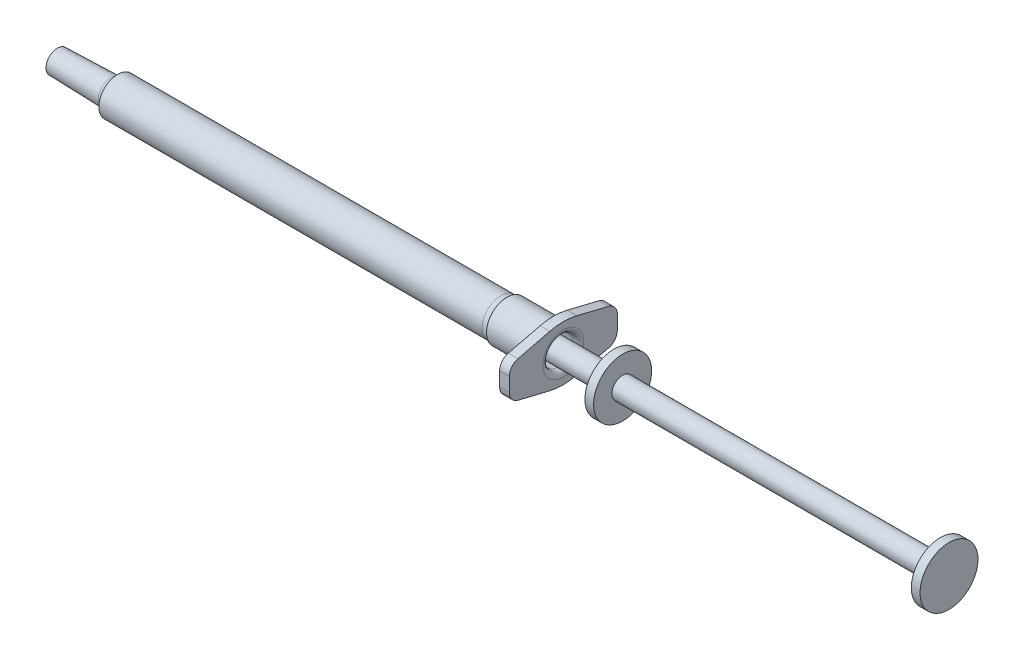
ISO-10303-21;
HEADER;
FILE_DESCRIPTION(('STEP AP214'),'2;1');
FILE_NAME('part.step','',(''),(''),'','','');
FILE_SCHEMA(('AUTOMOTIVE_DESIGN { 1 0 10303 214 1 1 1 1 }'));
ENDSEC;
DATA;
#1=APPLICATION_CONTEXT('core data for automotive mechanical design processes');
#2=APPLICATION_PROTOCOL_DEFINITION('international standard','automotive_design',2000,#1);
#3=PRODUCT_CONTEXT('',#1,'mechanical');
#4=PRODUCT('Part','Part','',(#3));
#5=PRODUCT_RELATED_PRODUCT_CATEGORY('part','',(#4));
#6=PRODUCT_DEFINITION_FORMATION('','',#4);
#7=PRODUCT_DEFINITION_CONTEXT('part definition',#1,'design');
#8=PRODUCT_DEFINITION('design','',#6,#7);
#9=PRODUCT_DEFINITION_SHAPE('','',#8);
#10=(LENGTH_UNIT() NAMED_UNIT(*) SI_UNIT(.MILLI.,.METRE.));
#11=(NAMED_UNIT(*) PLANE_ANGLE_UNIT() SI_UNIT($,.RADIAN.));
#12=(NAMED_UNIT(*) SI_UNIT($,.STERADIAN.) SOLID_ANGLE_UNIT());
#13=UNCERTAINTY_MEASURE_WITH_UNIT(LENGTH_MEASURE(1.E-05),#10,'distance_accuracy_value','');
#14=(GEOMETRIC_REPRESENTATION_CONTEXT(3) GLOBAL_UNCERTAINTY_ASSIGNED_CONTEXT((#13)) GLOBAL_UNIT_ASSIGNED_CONTEXT((#10,
#11,#12)) REPRESENTATION_CONTEXT('',''));
#15=CARTESIAN_POINT('',(0.,0.,0.));
#16=DIRECTION('',(0.,0.,1.));
#17=DIRECTION('',(1.,0.,0.));
#18=AXIS2_PLACEMENT_3D('',#15,#16,#17);
#19=CARTESIAN_POINT('',(11.168160758688,2.53109089025904,0.));
#20=DIRECTION('',(1.,0.,0.));
#21=DIRECTION('',(0.,0.,-1.));
#22=AXIS2_PLACEMENT_3D('',#19,#20,#21);
#23=CONICAL_SURFACE('',#22,2.54455467620265,1.31977107893144);
#24=CARTESIAN_POINT('',(10.5156496587241,2.53109089025904,0.));
#25=VERTEX_POINT('',#24);
#26=VERTEX_LOOP('',#25);
#27=FACE_BOUND('',#26,.T.);
#28=CARTESIAN_POINT('',(11.168160758688,2.53109089025904,0.));
#29=DIRECTION('',(1.,0.,0.));
#30=DIRECTION('',(0.,0.,-1.));
#31=AXIS2_PLACEMENT_3D('',#28,#29,#30);
#32=CIRCLE('',#31,2.54455467620265);
#33=CARTESIAN_POINT('',(11.168160758688,2.53109089025904,-2.54455467620265));
#34=VERTEX_POINT('',#33);
#35=EDGE_CURVE('E12',#34,#34,#32,.T.);
#36=ORIENTED_EDGE('',*,*,#35,.F.);
#37=EDGE_LOOP('',(#36));
#38=FACE_BOUND('',#37,.T.);
#39=ADVANCED_FACE('F44',(#27,#38),#23,.T.);
#40=CARTESIAN_POINT('',(105.8865547452,2.53109089025904,0.));
#41=DIRECTION('',(1.,0.,0.));
#42=DIRECTION('',(0.,0.,-1.));
#43=AXIS2_PLACEMENT_3D('',#40,#41,#42);
#44=CYLINDRICAL_SURFACE('',#43,2.54455467620265);
#45=ORIENTED_EDGE('',*,*,#35,.T.);
#46=EDGE_LOOP('',(#45));
#47=FACE_BOUND('',#46,.T.);
#48=CARTESIAN_POINT('',(16.3440700927071,2.53109089025904,0.));
#49=DIRECTION('',(1.,0.,0.));
#50=DIRECTION('',(0.,0.,-1.));
#51=AXIS2_PLACEMENT_3D('',#48,#49,#50);
#52=CIRCLE('',#51,2.54455467620265);
#53=CARTESIAN_POINT('',(16.3440700927071,2.53109089025904,-2.54455467620265));
#54=VERTEX_POINT('',#53);
#55=EDGE_CURVE('E50',#54,#54,#52,.T.);
#56=ORIENTED_EDGE('',*,*,#55,.F.);
#57=EDGE_LOOP('',(#56));
#58=FACE_BOUND('',#57,.T.);
#59=ADVANCED_FACE('F55',(#47,#58),#44,.T.);
#60=CARTESIAN_POINT('',(16.5055856602395,2.53109089025904,0.));
#61=DIRECTION('',(-1.,0.,0.));
#62=DIRECTION('',(0.,0.,1.));
#63=AXIS2_PLACEMENT_3D('',#60,#61,#62);
#64=CONICAL_SURFACE('',#63,1.89,1.32887276851603);
#65=ORIENTED_EDGE('',*,*,#55,.T.);
#66=EDGE_LOOP('',(#65));
#67=FACE_BOUND('',#66,.T.);
#68=CARTESIAN_POINT('',(16.5055856602395,2.53109089025904,0.));
#69=DIRECTION('',(1.,0.,0.));
#70=DIRECTION('',(0.,0.,-1.));
#71=AXIS2_PLACEMENT_3D('',#68,#69,#70);
#72=CIRCLE('',#71,1.89);
#73=CARTESIAN_POINT('',(16.5055856602395,2.53109089025904,-1.89));
#74=VERTEX_POINT('',#73);
#75=EDGE_CURVE('E64',#74,#74,#72,.T.);
#76=ORIENTED_EDGE('',*,*,#75,.F.);
#77=EDGE_LOOP('',(#76));
#78=FACE_BOUND('',#77,.T.);
#79=ADVANCED_FACE('F60',(#67,#78),#64,.T.);
#80=CARTESIAN_POINT('',(105.8865547452,2.53109089025904,0.));
#81=DIRECTION('',(1.,0.,0.));
#82=DIRECTION('',(0.,0.,-1.));
#83=AXIS2_PLACEMENT_3D('',#80,#81,#82);
#84=CYLINDRICAL_SURFACE('',#83,1.89);
#85=ORIENTED_EDGE('',*,*,#75,.T.);
#86=EDGE_LOOP('',(#85));
#87=FACE_BOUND('',#86,.T.);
#88=CARTESIAN_POINT('',(97.878125799525,2.53109089025904,0.));
#89=DIRECTION('',(1.,0.,0.));
#90=DIRECTION('',(0.,0.,-1.));
#91=AXIS2_PLACEMENT_3D('',#88,#89,#90);
#92=CIRCLE('',#91,1.89);
#93=CARTESIAN_POINT('',(97.878125799525,2.53109089025904,-1.89));
#94=VERTEX_POINT('',#93);
#95=EDGE_CURVE('E66',#94,#94,#92,.T.);
#96=ORIENTED_EDGE('',*,*,#95,.F.);
#97=EDGE_LOOP('',(#96));
#98=FACE_BOUND('',#97,.T.);
#99=ADVANCED_FACE('F120',(#87,#98),#84,.T.);
#100=CARTESIAN_POINT('',(97.878125799525,4.42109089025904,0.));
#101=DIRECTION('',(-1.,0.,0.));
#102=DIRECTION('',(0.,0.,1.));
#103=AXIS2_PLACEMENT_3D('',#100,#101,#102);
#104=PLANE('',#103);
#105=ORIENTED_EDGE('',*,*,#95,.T.);
#106=EDGE_LOOP('',(#105));
#107=FACE_BOUND('',#106,.T.);
#108=CARTESIAN_POINT('',(97.878125799525,2.53109089025904,0.));
#109=DIRECTION('',(1.,0.,0.));
#110=DIRECTION('',(0.,0.,-1.));
#111=AXIS2_PLACEMENT_3D('',#108,#109,#110);
#112=CIRCLE('',#111,5.1);
#113=CARTESIAN_POINT('',(97.878125799525,2.53109089025904,-5.1));
#114=VERTEX_POINT('',#113);
#115=EDGE_CURVE('E71',#114,#114,#112,.T.);
#116=ORIENTED_EDGE('',*,*,#115,.F.);
#117=EDGE_LOOP('',(#116));
#118=FACE_BOUND('',#117,.T.);
#119=ADVANCED_FACE('F116',(#107,#118),#104,.T.);
#120=CARTESIAN_POINT('',(105.8865547452,2.53109089025904,0.));
#121=DIRECTION('',(1.,0.,0.));
#122=DIRECTION('',(0.,0.,-1.));
#123=AXIS2_PLACEMENT_3D('',#120,#121,#122);
#124=CYLINDRICAL_SURFACE('',#123,5.1);
#125=ORIENTED_EDGE('',*,*,#115,.T.);
#126=EDGE_LOOP('',(#125));
#127=FACE_BOUND('',#126,.T.);
#128=CARTESIAN_POINT('',(99.408125799525,2.53109089025904,0.));
#129=DIRECTION('',(1.,0.,0.));
#130=DIRECTION('',(0.,0.,-1.));
#131=AXIS2_PLACEMENT_3D('',#128,#129,#130);
#132=CIRCLE('',#131,5.1);
#133=CARTESIAN_POINT('',(99.408125799525,2.53109089025904,-5.1));
#134=VERTEX_POINT('',#133);
#135=EDGE_CURVE('E74',#134,#134,#132,.T.);
#136=ORIENTED_EDGE('',*,*,#135,.F.);
#137=EDGE_LOOP('',(#136));
#138=FACE_BOUND('',#137,.T.);
#139=ADVANCED_FACE('F112',(#127,#138),#124,.T.);
#140=CARTESIAN_POINT('',(99.408125799525,7.63109089025904,0.));
#141=DIRECTION('',(1.,0.,0.));
#142=DIRECTION('',(0.,0.,-1.));
#143=AXIS2_PLACEMENT_3D('',#140,#141,#142);
#144=PLANE('',#143);
#145=ORIENTED_EDGE('',*,*,#135,.T.);
#146=EDGE_LOOP('',(#145));
#147=FACE_BOUND('',#146,.T.);
#148=CARTESIAN_POINT('',(99.408125799525,2.53109089025904,0.));
#149=DIRECTION('',(1.,0.,0.));
#150=DIRECTION('',(0.,0.,-1.));
#151=AXIS2_PLACEMENT_3D('',#148,#149,#150);
#152=CIRCLE('',#151,1.89);
#153=CARTESIAN_POINT('',(99.408125799525,2.53109089025904,-1.89));
#154=VERTEX_POINT('',#153);
#155=EDGE_CURVE('E77',#154,#154,#152,.T.);
#156=ORIENTED_EDGE('',*,*,#155,.F.);
#157=EDGE_LOOP('',(#156));
#158=FACE_BOUND('',#157,.T.);
#159=ADVANCED_FACE('F108',(#147,#158),#144,.T.);
#160=CARTESIAN_POINT('',(105.8865547452,2.53109089025904,0.));
#161=DIRECTION('',(1.,0.,0.));
#162=DIRECTION('',(0.,0.,-1.));
#163=AXIS2_PLACEMENT_3D('',#160,#161,#162);
#164=CYLINDRICAL_SURFACE('',#163,1.89);
#165=ORIENTED_EDGE('',*,*,#155,.T.);
#166=EDGE_LOOP('',(#165));
#167=FACE_BOUND('',#166,.T.);
#168=CARTESIAN_POINT('',(155.278125799525,2.53109089025904,0.));
#169=DIRECTION('',(1.,0.,0.));
#170=DIRECTION('',(0.,0.,-1.));
#171=AXIS2_PLACEMENT_3D('',#168,#169,#170);
#172=CIRCLE('',#171,1.89);
#173=CARTESIAN_POINT('',(155.278125799525,2.53109089025904,-1.89));
#174=VERTEX_POINT('',#173);
#175=EDGE_CURVE('E80',#174,#174,#172,.T.);
#176=ORIENTED_EDGE('',*,*,#175,.F.);
#177=EDGE_LOOP('',(#176));
#178=FACE_BOUND('',#177,.T.);
#179=ADVANCED_FACE('F102',(#167,#178),#164,.T.);
#180=CARTESIAN_POINT('',(155.278125799525,4.42109089025904,0.));
#181=DIRECTION('',(-1.,0.,0.));
#182=DIRECTION('',(0.,0.,1.));
#183=AXIS2_PLACEMENT_3D('',#180,#181,#182);
#184=PLANE('',#183);
#185=ORIENTED_EDGE('',*,*,#175,.T.);
#186=EDGE_LOOP('',(#185));
#187=FACE_BOUND('',#186,.T.);
#188=CARTESIAN_POINT('',(155.278125799525,2.53109089025904,0.));
#189=DIRECTION('',(1.,0.,0.));
#190=DIRECTION('',(0.,0.,-1.));
#191=AXIS2_PLACEMENT_3D('',#188,#189,#190);
#192=CIRCLE('',#191,5.1);
#193=CARTESIAN_POINT('',(155.278125799525,2.53109089025904,-5.1));
#194=VERTEX_POINT('',#193);
#195=EDGE_CURVE('E83',#194,#194,#192,.T.);
#196=ORIENTED_EDGE('',*,*,#195,.F.);
#197=EDGE_LOOP('',(#196));
#198=FACE_BOUND('',#197,.T.);
#199=ADVANCED_FACE('F94',(#187,#198),#184,.T.);
#200=CARTESIAN_POINT('',(105.8865547452,2.53109089025904,0.));
#201=DIRECTION('',(1.,0.,0.));
#202=DIRECTION('',(0.,0.,-1.));
#203=AXIS2_PLACEMENT_3D('',#200,#201,#202);
#204=CYLINDRICAL_SURFACE('',#203,5.1);
#205=ORIENTED_EDGE('',*,*,#195,.T.);
#206=EDGE_LOOP('',(#205));
#207=FACE_BOUND('',#206,.T.);
#208=CARTESIAN_POINT('',(156.808125799525,2.53109089025904,0.));
#209=DIRECTION('',(1.,0.,0.));
#210=DIRECTION('',(0.,0.,-1.));
#211=AXIS2_PLACEMENT_3D('',#208,#209,#210);
#212=CIRCLE('',#211,5.1);
#213=CARTESIAN_POINT('',(156.808125799525,2.53109089025904,-5.1));
#214=VERTEX_POINT('',#213);
#215=EDGE_CURVE('E86',#214,#214,#212,.T.);
#216=ORIENTED_EDGE('',*,*,#215,.F.);
#217=EDGE_LOOP('',(#216));
#218=FACE_BOUND('',#217,.T.);
#219=ADVANCED_FACE('F92',(#207,#218),#204,.T.);
#220=CARTESIAN_POINT('',(156.808125799525,7.63109089025904,0.));
#221=DIRECTION('',(1.,0.,0.));
#222=DIRECTION('',(0.,0.,-1.));
#223=AXIS2_PLACEMENT_3D('',#220,#221,#222);
#224=PLANE('',#223);
#225=ORIENTED_EDGE('',*,*,#215,.T.);
#226=EDGE_LOOP('',(#225));
#227=FACE_BOUND('',#226,.T.);
#228=ADVANCED_FACE('F90',(#227),#224,.T.);
#229=CLOSED_SHELL('',(#39,#59,#79,#99,#119,#139,#159,#179,#199,#219,#228));
#230=MANIFOLD_SOLID_BREP('B2',#229);
#231=CARTESIAN_POINT('',(0.,3.41109089025904,0.));
#232=DIRECTION('',(1.,0.,0.));
#233=DIRECTION('',(0.,0.,-1.));
#234=AXIS2_PLACEMENT_3D('',#231,#232,#233);
#235=PLANE('',#234);
#236=CARTESIAN_POINT('',(0.,2.53109089025904,0.));
#237=DIRECTION('',(-1.,0.,0.));
#238=DIRECTION('',(0.,0.,1.));
#239=AXIS2_PLACEMENT_3D('',#236,#237,#238);
#240=CIRCLE('',#239,0.88);
#241=CARTESIAN_POINT('',(0.,2.53109089025904,0.88));
#242=VERTEX_POINT('',#241);
#243=EDGE_CURVE('E333',#242,#242,#240,.T.);
#244=ORIENTED_EDGE('',*,*,#243,.F.);
#245=EDGE_LOOP('',(#244));
#246=FACE_BOUND('',#245,.T.);
#247=CARTESIAN_POINT('',(0.,2.53109089025904,0.));
#248=DIRECTION('',(-1.,0.,0.));
#249=DIRECTION('',(0.,0.,1.));
#250=AXIS2_PLACEMENT_3D('',#247,#248,#249);
#251=CIRCLE('',#250,2.);
#252=CARTESIAN_POINT('',(0.,2.53109089025904,2.));
#253=VERTEX_POINT('',#252);
#254=EDGE_CURVE('E319',#253,#253,#251,.T.);
#255=ORIENTED_EDGE('',*,*,#254,.T.);
#256=EDGE_LOOP('',(#255));
#257=FACE_BOUND('',#256,.T.);
#258=ADVANCED_FACE('F206',(#246,#257),#235,.F.);
#259=CARTESIAN_POINT('',(10.,2.53109089025904,0.));
#260=DIRECTION('',(1.,0.,0.));
#261=DIRECTION('',(0.,0.,-1.));
#262=AXIS2_PLACEMENT_3D('',#259,#260,#261);
#263=CONICAL_SURFACE('',#262,2.27,0.0269934418682879);
#264=CARTESIAN_POINT('',(9.439537633338,2.53109089025904,0.));
#265=DIRECTION('',(1.,0.,0.));
#266=DIRECTION('',(0.,0.,-1.));
#267=AXIS2_PLACEMENT_3D('',#264,#265,#266);
#268=CIRCLE('',#267,2.25486751610013);
#269=CARTESIAN_POINT('',(9.439537633338,2.53109089025904,-2.25486751610013));
#270=VERTEX_POINT('',#269);
#271=EDGE_CURVE('E408',#270,#270,#268,.F.);
#272=ORIENTED_EDGE('',*,*,#271,.T.);
#273=EDGE_LOOP('',(#272));
#274=FACE_BOUND('',#273,.T.);
#275=ORIENTED_EDGE('',*,*,#254,.F.);
#276=EDGE_LOOP('',(#275));
#277=FACE_BOUND('',#276,.T.);
#278=ADVANCED_FACE('F429',(#274,#277),#263,.T.);
#279=CARTESIAN_POINT('',(10.5922188911448,2.53109089025904,0.));
#280=DIRECTION('',(1.,0.,0.));
#281=DIRECTION('',(0.,0.,-1.));
#282=AXIS2_PLACEMENT_3D('',#279,#280,#281);
#283=CONICAL_SURFACE('',#282,3.3,1.04898474546146);
#284=CARTESIAN_POINT('',(10.279465086832,2.53109089025904,0.));
#285=DIRECTION('',(1.,0.,0.));
#286=DIRECTION('',(0.,0.,-1.));
#287=AXIS2_PLACEMENT_3D('',#284,#285,#286);
#288=CIRCLE('',#287,2.75605176859606);
#289=CARTESIAN_POINT('',(10.279465086832,2.53109089025904,-2.75605176859606));
#290=VERTEX_POINT('',#289);
#291=EDGE_CURVE('E411',#290,#290,#288,.T.);
#292=ORIENTED_EDGE('',*,*,#291,.T.);
#293=EDGE_LOOP('',(#292));
#294=FACE_BOUND('',#293,.T.);
#295=CARTESIAN_POINT('',(10.5922188911448,2.53109089025904,0.));
#296=DIRECTION('',(-1.,0.,0.));
#297=DIRECTION('',(0.,0.,1.));
#298=AXIS2_PLACEMENT_3D('',#295,#296,#297);
#299=CIRCLE('',#298,3.3);
#300=CARTESIAN_POINT('',(10.5922188911448,2.53109089025904,3.3));
#301=VERTEX_POINT('',#300);
#302=EDGE_CURVE('E348',#301,#301,#299,.T.);
#303=ORIENTED_EDGE('',*,*,#302,.T.);
#304=EDGE_LOOP('',(#303));
#305=FACE_BOUND('',#304,.T.);
#306=ADVANCED_FACE('F435',(#294,#305),#283,.T.);
#307=CARTESIAN_POINT('',(0.,2.53109089025904,0.));
#308=DIRECTION('',(-1.,0.,0.));
#309=DIRECTION('',(0.,0.,1.));
#310=AXIS2_PLACEMENT_3D('',#307,#308,#309);
#311=CYLINDRICAL_SURFACE('',#310,3.3);
#312=CARTESIAN_POINT('',(78.0007331134536,2.53109089025904,0.));
#313=DIRECTION('',(1.,0.,0.));
#314=DIRECTION('',(0.,0.,-1.));
#315=AXIS2_PLACEMENT_3D('',#312,#313,#314);
#316=CIRCLE('',#315,3.3);
#317=CARTESIAN_POINT('',(78.0007331134536,2.53109089025904,-3.3));
#318=VERTEX_POINT('',#317);
#319=EDGE_CURVE('E366',#318,#318,#316,.F.);
#320=ORIENTED_EDGE('',*,*,#319,.T.);
#321=EDGE_LOOP('',(#320));
#322=FACE_BOUND('',#321,.T.);
#323=ORIENTED_EDGE('',*,*,#302,.F.);
#324=EDGE_LOOP('',(#323));
#325=FACE_BOUND('',#324,.T.);
#326=ADVANCED_FACE('F479',(#322,#325),#311,.T.);
#327=CARTESIAN_POINT('',(0.,2.53109089025904,0.));
#328=DIRECTION('',(-1.,0.,0.));
#329=DIRECTION('',(0.,0.,1.));
#330=AXIS2_PLACEMENT_3D('',#327,#328,#329);
#331=CYLINDRICAL_SURFACE('',#330,3.615);
#332=CARTESIAN_POINT('',(86.2781257995249,2.53109089025904,0.));
#333=DIRECTION('',(-1.,0.,0.));
#334=DIRECTION('',(0.,0.,1.));
#335=AXIS2_PLACEMENT_3D('',#332,#333,#334);
#336=CIRCLE('',#335,3.615);
#337=CARTESIAN_POINT('',(86.2781257995249,2.53109089025904,3.615));
#338=VERTEX_POINT('',#337);
#339=EDGE_CURVE('E402',#338,#338,#336,.T.);
#340=ORIENTED_EDGE('',*,*,#339,.T.);
#341=EDGE_LOOP('',(#340));
#342=FACE_BOUND('',#341,.T.);
#343=CARTESIAN_POINT('',(79.078125799525,2.53109089025904,0.));
#344=DIRECTION('',(-1.,0.,0.));
#345=DIRECTION('',(0.,0.,1.));
#346=AXIS2_PLACEMENT_3D('',#343,#344,#345);
#347=CIRCLE('',#346,3.615);
#348=CARTESIAN_POINT('',(79.078125799525,2.53109089025904,3.615));
#349=VERTEX_POINT('',#348);
#350=EDGE_CURVE('E345',#349,#349,#347,.T.);
#351=ORIENTED_EDGE('',*,*,#350,.F.);
#352=EDGE_LOOP('',(#351));
#353=FACE_BOUND('',#352,.T.);
#354=ADVANCED_FACE('F476',(#342,#353),#331,.T.);
#355=CARTESIAN_POINT('',(0.,2.53109089025904,0.));
#356=DIRECTION('',(-1.,0.,0.));
#357=DIRECTION('',(0.,0.,1.));
#358=AXIS2_PLACEMENT_3D('',#355,#356,#357);
#359=CYLINDRICAL_SURFACE('',#358,2.59324382681694);
#360=CARTESIAN_POINT('',(87.9781257995249,2.53109089025904,0.));
#361=DIRECTION('',(-1.,0.,0.));
#362=DIRECTION('',(0.,0.,1.));
#363=AXIS2_PLACEMENT_3D('',#360,#361,#362);
#364=CIRCLE('',#363,2.59324382681694);
#365=CARTESIAN_POINT('',(87.9781257995249,2.53109089025904,2.59324382681694));
#366=VERTEX_POINT('',#365);
#367=EDGE_CURVE('E214',#366,#366,#364,.F.);
#368=ORIENTED_EDGE('',*,*,#367,.T.);
#369=EDGE_LOOP('',(#368));
#370=FACE_BOUND('',#369,.T.);
#371=CARTESIAN_POINT('',(10.9433461420971,2.53109089025904,0.));
#372=DIRECTION('',(-1.,0.,0.));
#373=DIRECTION('',(0.,0.,1.));
#374=AXIS2_PLACEMENT_3D('',#371,#372,#373);
#375=CIRCLE('',#374,2.59324382681694);
#376=CARTESIAN_POINT('',(10.9433461420971,2.53109089025904,2.59324382681694));
#377=VERTEX_POINT('',#376);
#378=EDGE_CURVE('E342',#377,#377,#375,.T.);
#379=ORIENTED_EDGE('',*,*,#378,.T.);
#380=EDGE_LOOP('',(#379));
#381=FACE_BOUND('',#380,.T.);
#382=ADVANCED_FACE('F416',(#370,#381),#359,.F.);
#383=CARTESIAN_POINT('',(10.5922188911448,2.53109089025904,0.));
#384=DIRECTION('',(1.,0.,0.));
#385=DIRECTION('',(0.,0.,-1.));
#386=AXIS2_PLACEMENT_3D('',#383,#384,#385);
#387=CONICAL_SURFACE('',#386,1.26064312457233,1.31316183652608);
#388=ORIENTED_EDGE('',*,*,#378,.F.);
#389=EDGE_LOOP('',(#388));
#390=FACE_BOUND('',#389,.T.);
#391=CARTESIAN_POINT('',(10.5922188911448,2.53109089025904,0.));
#392=DIRECTION('',(-1.,0.,0.));
#393=DIRECTION('',(0.,0.,1.));
#394=AXIS2_PLACEMENT_3D('',#391,#392,#393);
#395=CIRCLE('',#394,1.26064312457233);
#396=CARTESIAN_POINT('',(10.5922188911448,2.53109089025904,1.26064312457233));
#397=VERTEX_POINT('',#396);
#398=EDGE_CURVE('E339',#397,#397,#395,.T.);
#399=ORIENTED_EDGE('',*,*,#398,.T.);
#400=EDGE_LOOP('',(#399));
#401=FACE_BOUND('',#400,.T.);
#402=ADVANCED_FACE('F497',(#390,#401),#387,.F.);
#403=CARTESIAN_POINT('',(10.,2.53109089025904,0.));
#404=DIRECTION('',(1.,0.,0.));
#405=DIRECTION('',(0.,0.,-1.));
#406=AXIS2_PLACEMENT_3D('',#403,#404,#405);
#407=CONICAL_SURFACE('',#406,0.88,0.571255010904347);
#408=ORIENTED_EDGE('',*,*,#398,.F.);
#409=EDGE_LOOP('',(#408));
#410=FACE_BOUND('',#409,.T.);
#411=CARTESIAN_POINT('',(10.,2.53109089025904,0.));
#412=DIRECTION('',(-1.,0.,0.));
#413=DIRECTION('',(0.,0.,1.));
#414=AXIS2_PLACEMENT_3D('',#411,#412,#413);
#415=CIRCLE('',#414,0.88);
#416=CARTESIAN_POINT('',(10.,2.53109089025904,0.88));
#417=VERTEX_POINT('',#416);
#418=EDGE_CURVE('E336',#417,#417,#415,.T.);
#419=ORIENTED_EDGE('',*,*,#418,.T.);
#420=EDGE_LOOP('',(#419));
#421=FACE_BOUND('',#420,.T.);
#422=ADVANCED_FACE('F500',(#410,#421),#407,.F.);
#423=CARTESIAN_POINT('',(0.,2.53109089025904,0.));
#424=DIRECTION('',(-1.,0.,0.));
#425=DIRECTION('',(0.,0.,1.));
#426=AXIS2_PLACEMENT_3D('',#423,#424,#425);
#427=CYLINDRICAL_SURFACE('',#426,0.88);
#428=ORIENTED_EDGE('',*,*,#418,.F.);
#429=EDGE_LOOP('',(#428));
#430=FACE_BOUND('',#429,.T.);
#431=ORIENTED_EDGE('',*,*,#243,.T.);
#432=EDGE_LOOP('',(#431));
#433=FACE_BOUND('',#432,.T.);
#434=ADVANCED_FACE('F504',(#430,#433),#427,.F.);
#435=CARTESIAN_POINT('',(87.2781257995249,0.,0.));
#436=DIRECTION('',(-1.,0.,0.));
#437=DIRECTION('',(0.,0.,1.));
#438=AXIS2_PLACEMENT_3D('',#435,#436,#437);
#439=PLANE('',#438);
#440=CARTESIAN_POINT('',(87.2781257995249,2.53109089025904,0.));
#441=DIRECTION('',(-1.,0.,0.));
#442=DIRECTION('',(0.,0.,1.));
#443=AXIS2_PLACEMENT_3D('',#440,#441,#442);
#444=CIRCLE('',#443,4.615);
#445=CARTESIAN_POINT('',(87.2781257995249,2.53109089025904,4.615));
#446=VERTEX_POINT('',#445);
#447=EDGE_CURVE('E405',#446,#446,#444,.F.);
#448=ORIENTED_EDGE('',*,*,#447,.T.);
#449=EDGE_LOOP('',(#448));
#450=FACE_BOUND('',#449,.T.);
#451=DIRECTION('',(0.,-0.233936693713886,-0.972251831232122));
#452=VECTOR('',#451,1.);
#453=CARTESIAN_POINT('',(87.278125799525,-0.26437007273038,9.4993581080756));
#454=LINE('',#453,#452);
#455=CARTESIAN_POINT('',(87.278125799525,-0.633020069143326,7.96723149550337));
#456=VERTEX_POINT('',#455);
#457=CARTESIAN_POINT('',(87.278125799525,-1.97914679387972,2.37266592129661));
#458=VERTEX_POINT('',#457);
#459=EDGE_CURVE('E325',#456,#458,#454,.T.);
#460=ORIENTED_EDGE('',*,*,#459,.F.);
#461=CARTESIAN_POINT('',(87.2781257995249,1.31148359332092,7.4993581080756));
#462=DIRECTION('',(-1.,0.,0.));
#463=DIRECTION('',(0.,0.,1.));
#464=AXIS2_PLACEMENT_3D('',#461,#462,#463);
#465=CIRCLE('',#464,2.);
#466=CARTESIAN_POINT('',(87.278125799525,1.31148359332092,9.4993581080756));
#467=VERTEX_POINT('',#466);
#468=EDGE_CURVE('E377',#456,#467,#465,.T.);
#469=ORIENTED_EDGE('',*,*,#468,.T.);
#470=DIRECTION('',(0.,-1.,0.));
#471=VECTOR('',#470,1.);
#472=CARTESIAN_POINT('',(87.278125799525,-0.26437007273038,9.4993581080756));
#473=LINE('',#472,#471);
#474=CARTESIAN_POINT('',(87.278125799525,3.75847259130389,9.4993581080756));
#475=VERTEX_POINT('',#474);
#476=EDGE_CURVE('E329',#475,#467,#473,.T.);
#477=ORIENTED_EDGE('',*,*,#476,.F.);
#478=CARTESIAN_POINT('',(87.2781257995249,3.75847259130389,7.4993581080756));
#479=DIRECTION('',(-1.,0.,0.));
#480=DIRECTION('',(0.,0.,1.));
#481=AXIS2_PLACEMENT_3D('',#478,#479,#480);
#482=CIRCLE('',#481,2.);
#483=CARTESIAN_POINT('',(87.278125799525,5.70070538134884,7.9765706281065));
#484=VERTEX_POINT('',#483);
#485=EDGE_CURVE('E375',#475,#484,#482,.T.);
#486=ORIENTED_EDGE('',*,*,#485,.T.);
#487=DIRECTION('',(0.,-0.23860626001545,0.971116395022471));
#488=VECTOR('',#487,1.);
#489=CARTESIAN_POINT('',(87.278125799525,5.32655185324846,9.4993581080756));
#490=LINE('',#489,#488);
#491=CARTESIAN_POINT('',(87.278125799525,7.07431025402232,2.3860626001545));
#492=VERTEX_POINT('',#491);
#493=EDGE_CURVE('E552',#492,#484,#490,.T.);
#494=ORIENTED_EDGE('',*,*,#493,.F.);
#495=CARTESIAN_POINT('',(87.2781257995249,-2.63685369620239,0.));
#496=DIRECTION('',(-1.,0.,0.));
#497=DIRECTION('',(0.,0.,1.));
#498=AXIS2_PLACEMENT_3D('',#495,#496,#497);
#499=CIRCLE('',#498,10.);
#500=CARTESIAN_POINT('',(87.278125799525,7.07431025402232,-2.3860626001545));
#501=VERTEX_POINT('',#500);
#502=EDGE_CURVE('E309',#492,#501,#499,.T.);
#503=ORIENTED_EDGE('',*,*,#502,.T.);
#504=DIRECTION('',(0.,0.23860626001545,0.971116395022471));
#505=VECTOR('',#504,1.);
#506=CARTESIAN_POINT('',(87.278125799525,5.32655185324846,-9.4993581080756));
#507=LINE('',#506,#505);
#508=CARTESIAN_POINT('',(87.278125799525,5.70070538134884,-7.9765706281065));
#509=VERTEX_POINT('',#508);
#510=EDGE_CURVE('E553',#509,#501,#507,.T.);
#511=ORIENTED_EDGE('',*,*,#510,.F.);
#512=CARTESIAN_POINT('',(87.2781257995249,3.75847259130389,-7.4993581080756));
#513=DIRECTION('',(-1.,0.,0.));
#514=DIRECTION('',(0.,0.,1.));
#515=AXIS2_PLACEMENT_3D('',#512,#513,#514);
#516=CIRCLE('',#515,2.);
#517=CARTESIAN_POINT('',(87.278125799525,3.75847259130389,-9.4993581080756));
#518=VERTEX_POINT('',#517);
#519=EDGE_CURVE('E372',#509,#518,#516,.T.);
#520=ORIENTED_EDGE('',*,*,#519,.T.);
#521=DIRECTION('',(0.,1.,0.));
#522=VECTOR('',#521,1.);
#523=CARTESIAN_POINT('',(87.278125799525,-0.26437007273038,-9.4993581080756));
#524=LINE('',#523,#522);
#525=CARTESIAN_POINT('',(87.278125799525,1.31489638687744,-9.4993581080756));
#526=VERTEX_POINT('',#525);
#527=EDGE_CURVE('E557',#526,#518,#524,.T.);
#528=ORIENTED_EDGE('',*,*,#527,.F.);
#529=CARTESIAN_POINT('',(87.2781257995249,1.31489638687744,-7.4993581080756));
#530=DIRECTION('',(-1.,0.,0.));
#531=DIRECTION('',(0.,0.,1.));
#532=AXIS2_PLACEMENT_3D('',#529,#530,#531);
#533=CIRCLE('',#532,2.);
#534=CARTESIAN_POINT('',(87.278125799525,-0.630587302116046,-7.96313953920485));
#535=VERTEX_POINT('',#534);
#536=EDGE_CURVE('E323',#526,#535,#533,.T.);
#537=ORIENTED_EDGE('',*,*,#536,.T.);
#538=DIRECTION('',(0.,0.231890715564622,-0.972741844496744));
#539=VECTOR('',#538,1.);
#540=CARTESIAN_POINT('',(87.278125799525,-2.53942688798893,0.0441156675821653));
#541=LINE('',#540,#539);
#542=CARTESIAN_POINT('',(87.278125799525,-1.98404692652593,-2.28560817148847));
#543=VERTEX_POINT('',#542);
#544=EDGE_CURVE('E315',#543,#535,#541,.T.);
#545=ORIENTED_EDGE('',*,*,#544,.F.);
#546=CARTESIAN_POINT('',(87.2781257995249,7.74337151844151,0.0332989841577568));
#547=DIRECTION('',(-1.,0.,0.));
#548=DIRECTION('',(0.,0.,1.));
#549=AXIS2_PLACEMENT_3D('',#546,#547,#548);
#550=CIRCLE('',#549,10.);
#551=EDGE_CURVE('E299',#543,#458,#550,.T.);
#552=ORIENTED_EDGE('',*,*,#551,.T.);
#553=EDGE_LOOP('',(#460,#469,#477,#486,#494,#503,#511,#520,#528,#537,#545,#552));
#554=FACE_BOUND('',#553,.T.);
#555=ADVANCED_FACE('F321',(#450,#554),#439,.T.);
#556=CARTESIAN_POINT('',(88.9781257995249,0.,0.));
#557=DIRECTION('',(-1.,0.,0.));
#558=DIRECTION('',(0.,0.,1.));
#559=AXIS2_PLACEMENT_3D('',#556,#557,#558);
#560=PLANE('',#559);
#561=CARTESIAN_POINT('',(88.9781257995249,2.53109089025904,0.));
#562=DIRECTION('',(-1.,0.,0.));
#563=DIRECTION('',(0.,0.,1.));
#564=AXIS2_PLACEMENT_3D('',#561,#562,#563);
#565=CIRCLE('',#564,3.59324382681694);
#566=CARTESIAN_POINT('',(88.9781257995249,2.53109089025904,3.59324382681694));
#567=VERTEX_POINT('',#566);
#568=EDGE_CURVE('E42',#567,#567,#565,.T.);
#569=ORIENTED_EDGE('',*,*,#568,.T.);
#570=EDGE_LOOP('',(#569));
#571=FACE_BOUND('',#570,.T.);
#572=DIRECTION('',(0.,-1.,0.));
#573=VECTOR('',#572,1.);
#574=CARTESIAN_POINT('',(88.978125799525,-0.26437007273038,9.4993581080756));
#575=LINE('',#574,#573);
#576=CARTESIAN_POINT('',(88.978125799525,3.75847259130389,9.4993581080756));
#577=VERTEX_POINT('',#576);
#578=CARTESIAN_POINT('',(88.978125799525,1.31148359332092,9.4993581080756));
#579=VERTEX_POINT('',#578);
#580=EDGE_CURVE('E540',#577,#579,#575,.T.);
#581=ORIENTED_EDGE('',*,*,#580,.T.);
#582=CARTESIAN_POINT('',(88.9781257995249,1.31148359332092,7.4993581080756));
#583=DIRECTION('',(-1.,0.,0.));
#584=DIRECTION('',(0.,0.,1.));
#585=AXIS2_PLACEMENT_3D('',#582,#583,#584);
#586=CIRCLE('',#585,2.);
#587=CARTESIAN_POINT('',(88.978125799525,-0.633020069143326,7.96723149550337));
#588=VERTEX_POINT('',#587);
#589=EDGE_CURVE('E389',#579,#588,#586,.F.);
#590=ORIENTED_EDGE('',*,*,#589,.T.);
#591=DIRECTION('',(0.,-0.233936693713886,-0.972251831232122));
#592=VECTOR('',#591,1.);
#593=CARTESIAN_POINT('',(88.978125799525,-0.26437007273038,9.4993581080756));
#594=LINE('',#593,#592);
#595=CARTESIAN_POINT('',(88.978125799525,-1.97914679387972,2.37266592129661));
#596=VERTEX_POINT('',#595);
#597=EDGE_CURVE('E545',#588,#596,#594,.T.);
#598=ORIENTED_EDGE('',*,*,#597,.T.);
#599=CARTESIAN_POINT('',(88.9781257995249,7.74337151844151,0.0332989841577568));
#600=DIRECTION('',(-1.,0.,0.));
#601=DIRECTION('',(0.,0.,1.));
#602=AXIS2_PLACEMENT_3D('',#599,#600,#601);
#603=CIRCLE('',#602,10.);
#604=CARTESIAN_POINT('',(88.978125799525,-1.98404692652593,-2.28560817148847));
#605=VERTEX_POINT('',#604);
#606=EDGE_CURVE('E358',#596,#605,#603,.F.);
#607=ORIENTED_EDGE('',*,*,#606,.T.);
#608=DIRECTION('',(0.,0.231890715564622,-0.972741844496744));
#609=VECTOR('',#608,1.);
#610=CARTESIAN_POINT('',(88.978125799525,-2.53942688798893,0.0441156675821653));
#611=LINE('',#610,#609);
#612=CARTESIAN_POINT('',(88.978125799525,-0.630587302116046,-7.96313953920485));
#613=VERTEX_POINT('',#612);
#614=EDGE_CURVE('E318',#605,#613,#611,.T.);
#615=ORIENTED_EDGE('',*,*,#614,.T.);
#616=CARTESIAN_POINT('',(88.9781257995249,1.31489638687744,-7.4993581080756));
#617=DIRECTION('',(-1.,0.,0.));
#618=DIRECTION('',(0.,0.,1.));
#619=AXIS2_PLACEMENT_3D('',#616,#617,#618);
#620=CIRCLE('',#619,2.);
#621=CARTESIAN_POINT('',(88.978125799525,1.31489638687744,-9.4993581080756));
#622=VERTEX_POINT('',#621);
#623=EDGE_CURVE('E385',#613,#622,#620,.F.);
#624=ORIENTED_EDGE('',*,*,#623,.T.);
#625=DIRECTION('',(0.,1.,0.));
#626=VECTOR('',#625,1.);
#627=CARTESIAN_POINT('',(88.978125799525,-0.26437007273038,-9.4993581080756));
#628=LINE('',#627,#626);
#629=CARTESIAN_POINT('',(88.978125799525,3.75847259130389,-9.4993581080756));
#630=VERTEX_POINT('',#629);
#631=EDGE_CURVE('E324',#622,#630,#628,.T.);
#632=ORIENTED_EDGE('',*,*,#631,.T.);
#633=CARTESIAN_POINT('',(88.9781257995249,3.75847259130389,-7.4993581080756));
#634=DIRECTION('',(-1.,0.,0.));
#635=DIRECTION('',(0.,0.,1.));
#636=AXIS2_PLACEMENT_3D('',#633,#634,#635);
#637=CIRCLE('',#636,2.);
#638=CARTESIAN_POINT('',(88.978125799525,5.70070538134884,-7.9765706281065));
#639=VERTEX_POINT('',#638);
#640=EDGE_CURVE('E229',#630,#639,#637,.F.);
#641=ORIENTED_EDGE('',*,*,#640,.T.);
#642=DIRECTION('',(0.,0.23860626001545,0.971116395022471));
#643=VECTOR('',#642,1.);
#644=CARTESIAN_POINT('',(88.978125799525,5.32655185324846,-9.4993581080756));
#645=LINE('',#644,#643);
#646=CARTESIAN_POINT('',(88.978125799525,7.07431025402232,-2.3860626001545));
#647=VERTEX_POINT('',#646);
#648=EDGE_CURVE('E327',#639,#647,#645,.T.);
#649=ORIENTED_EDGE('',*,*,#648,.T.);
#650=CARTESIAN_POINT('',(88.9781257995249,-2.63685369620239,0.));
#651=DIRECTION('',(-1.,0.,0.));
#652=DIRECTION('',(0.,0.,1.));
#653=AXIS2_PLACEMENT_3D('',#650,#651,#652);
#654=CIRCLE('',#653,10.);
#655=CARTESIAN_POINT('',(88.978125799525,7.07431025402232,2.3860626001545));
#656=VERTEX_POINT('',#655);
#657=EDGE_CURVE('E356',#647,#656,#654,.F.);
#658=ORIENTED_EDGE('',*,*,#657,.T.);
#659=DIRECTION('',(0.,-0.23860626001545,0.971116395022471));
#660=VECTOR('',#659,1.);
#661=CARTESIAN_POINT('',(88.978125799525,5.32655185324846,9.4993581080756));
#662=LINE('',#661,#660);
#663=CARTESIAN_POINT('',(88.978125799525,5.70070538134884,7.9765706281065));
#664=VERTEX_POINT('',#663);
#665=EDGE_CURVE('E546',#656,#664,#662,.T.);
#666=ORIENTED_EDGE('',*,*,#665,.T.);
#667=CARTESIAN_POINT('',(88.9781257995249,3.75847259130389,7.4993581080756));
#668=DIRECTION('',(-1.,0.,0.));
#669=DIRECTION('',(0.,0.,1.));
#670=AXIS2_PLACEMENT_3D('',#667,#668,#669);
#671=CIRCLE('',#670,2.);
#672=EDGE_CURVE('E387',#664,#577,#671,.F.);
#673=ORIENTED_EDGE('',*,*,#672,.T.);
#674=EDGE_LOOP('',(#581,#590,#598,#607,#615,#624,#632,#641,#649,#658,#666,#673));
#675=FACE_BOUND('',#674,.T.);
#676=ADVANCED_FACE('F513',(#571,#675),#560,.F.);
#677=CARTESIAN_POINT('',(88.978125799525,-0.26437007273038,-9.4993581080756));
#678=DIRECTION('',(0.,0.,1.));
#679=DIRECTION('',(1.,0.,0.));
#680=AXIS2_PLACEMENT_3D('',#677,#678,#679);
#681=PLANE('',#680);
#682=ORIENTED_EDGE('',*,*,#631,.F.);
#683=DIRECTION('',(-1.,0.,0.));
#684=VECTOR('',#683,1.);
#685=CARTESIAN_POINT('',(88.978125799525,1.31489638687744,-9.4993581080756));
#686=LINE('',#685,#684);
#687=EDGE_CURVE('E394',#622,#526,#686,.T.);
#688=ORIENTED_EDGE('',*,*,#687,.T.);
#689=ORIENTED_EDGE('',*,*,#527,.T.);
#690=DIRECTION('',(-1.,0.,0.));
#691=VECTOR('',#690,1.);
#692=CARTESIAN_POINT('',(88.978125799525,3.75847259130389,-9.4993581080756));
#693=LINE('',#692,#691);
#694=EDGE_CURVE('E392',#518,#630,#693,.F.);
#695=ORIENTED_EDGE('',*,*,#694,.T.);
#696=EDGE_LOOP('',(#682,#688,#689,#695));
#697=FACE_BOUND('',#696,.T.);
#698=ADVANCED_FACE('F509',(#697),#681,.F.);
#699=CARTESIAN_POINT('',(88.978125799525,5.32655185324846,-9.4993581080756));
#700=DIRECTION('',(0.,-0.971116395022471,0.23860626001545));
#701=DIRECTION('',(0.,-0.23860626001545,-0.971116395022471));
#702=AXIS2_PLACEMENT_3D('',#699,#700,#701);
#703=PLANE('',#702);
#704=ORIENTED_EDGE('',*,*,#648,.F.);
#705=DIRECTION('',(-1.,0.,0.));
#706=VECTOR('',#705,1.);
#707=CARTESIAN_POINT('',(88.978125799525,5.70070538134884,-7.9765706281065));
#708=LINE('',#707,#706);
#709=EDGE_CURVE('E399',#639,#509,#708,.T.);
#710=ORIENTED_EDGE('',*,*,#709,.T.);
#711=ORIENTED_EDGE('',*,*,#510,.T.);
#712=DIRECTION('',(-1.,0.,0.));
#713=VECTOR('',#712,1.);
#714=CARTESIAN_POINT('',(88.978125799525,7.07431025402232,-2.3860626001545));
#715=LINE('',#714,#713);
#716=EDGE_CURVE('E363',#501,#647,#715,.F.);
#717=ORIENTED_EDGE('',*,*,#716,.T.);
#718=EDGE_LOOP('',(#704,#710,#711,#717));
#719=FACE_BOUND('',#718,.T.);
#720=ADVANCED_FACE('F512',(#719),#703,.F.);
#721=CARTESIAN_POINT('',(88.978125799525,5.32655185324846,9.4993581080756));
#722=DIRECTION('',(0.,-0.971116395022471,-0.23860626001545));
#723=DIRECTION('',(0.,0.23860626001545,-0.971116395022471));
#724=AXIS2_PLACEMENT_3D('',#721,#722,#723);
#725=PLANE('',#724);
#726=ORIENTED_EDGE('',*,*,#493,.T.);
#727=DIRECTION('',(-1.,0.,0.));
#728=VECTOR('',#727,1.);
#729=CARTESIAN_POINT('',(88.978125799525,5.70070538134884,7.9765706281065));
#730=LINE('',#729,#728);
#731=EDGE_CURVE('E221',#484,#664,#730,.F.);
#732=ORIENTED_EDGE('',*,*,#731,.T.);
#733=ORIENTED_EDGE('',*,*,#665,.F.);
#734=DIRECTION('',(-1.,0.,0.));
#735=VECTOR('',#734,1.);
#736=CARTESIAN_POINT('',(88.978125799525,7.07431025402232,2.3860626001545));
#737=LINE('',#736,#735);
#738=EDGE_CURVE('E360',#656,#492,#737,.T.);
#739=ORIENTED_EDGE('',*,*,#738,.T.);
#740=EDGE_LOOP('',(#726,#732,#733,#739));
#741=FACE_BOUND('',#740,.T.);
#742=ADVANCED_FACE('F517',(#741),#725,.F.);
#743=CARTESIAN_POINT('',(88.978125799525,-0.26437007273038,9.4993581080756));
#744=DIRECTION('',(0.,0.,-1.));
#745=DIRECTION('',(-1.,0.,0.));
#746=AXIS2_PLACEMENT_3D('',#743,#744,#745);
#747=PLANE('',#746);
#748=ORIENTED_EDGE('',*,*,#476,.T.);
#749=DIRECTION('',(-1.,0.,0.));
#750=VECTOR('',#749,1.);
#751=CARTESIAN_POINT('',(88.978125799525,1.31148359332092,9.4993581080756));
#752=LINE('',#751,#750);
#753=EDGE_CURVE('E382',#467,#579,#752,.F.);
#754=ORIENTED_EDGE('',*,*,#753,.T.);
#755=ORIENTED_EDGE('',*,*,#580,.F.);
#756=DIRECTION('',(-1.,0.,0.));
#757=VECTOR('',#756,1.);
#758=CARTESIAN_POINT('',(88.978125799525,3.75847259130389,9.4993581080756));
#759=LINE('',#758,#757);
#760=EDGE_CURVE('E379',#577,#475,#759,.T.);
#761=ORIENTED_EDGE('',*,*,#760,.T.);
#762=EDGE_LOOP('',(#748,#754,#755,#761));
#763=FACE_BOUND('',#762,.T.);
#764=ADVANCED_FACE('F521',(#763),#747,.F.);
#765=CARTESIAN_POINT('',(88.978125799525,-0.26437007273038,9.4993581080756));
#766=DIRECTION('',(0.,0.972251831232123,-0.233936693713886));
#767=DIRECTION('',(0.,0.233936693713886,0.972251831232123));
#768=AXIS2_PLACEMENT_3D('',#765,#766,#767);
#769=PLANE('',#768);
#770=ORIENTED_EDGE('',*,*,#597,.F.);
#771=DIRECTION('',(-1.,0.,0.));
#772=VECTOR('',#771,1.);
#773=CARTESIAN_POINT('',(88.978125799525,-0.633020069143326,7.96723149550337));
#774=LINE('',#773,#772);
#775=EDGE_CURVE('E369',#588,#456,#774,.T.);
#776=ORIENTED_EDGE('',*,*,#775,.T.);
#777=ORIENTED_EDGE('',*,*,#459,.T.);
#778=DIRECTION('',(-1.,0.,0.));
#779=VECTOR('',#778,1.);
#780=CARTESIAN_POINT('',(88.978125799525,-1.97914679387972,2.37266592129661));
#781=LINE('',#780,#779);
#782=EDGE_CURVE('E305',#458,#596,#781,.F.);
#783=ORIENTED_EDGE('',*,*,#782,.T.);
#784=EDGE_LOOP('',(#770,#776,#777,#783));
#785=FACE_BOUND('',#784,.T.);
#786=ADVANCED_FACE('F524',(#785),#769,.F.);
#787=CARTESIAN_POINT('',(88.978125799525,-2.53942688798893,0.0441156675821653));
#788=DIRECTION('',(0.,0.972741844496744,0.231890715564622));
#789=DIRECTION('',(0.,-0.231890715564622,0.972741844496744));
#790=AXIS2_PLACEMENT_3D('',#787,#788,#789);
#791=PLANE('',#790);
#792=ORIENTED_EDGE('',*,*,#544,.T.);
#793=DIRECTION('',(-1.,0.,0.));
#794=VECTOR('',#793,1.);
#795=CARTESIAN_POINT('',(88.978125799525,-0.630587302116045,-7.96313953920485));
#796=LINE('',#795,#794);
#797=EDGE_CURVE('E397',#535,#613,#796,.F.);
#798=ORIENTED_EDGE('',*,*,#797,.T.);
#799=ORIENTED_EDGE('',*,*,#614,.F.);
#800=DIRECTION('',(-1.,0.,0.));
#801=VECTOR('',#800,1.);
#802=CARTESIAN_POINT('',(88.978125799525,-1.98404692652593,-2.28560817148847));
#803=LINE('',#802,#801);
#804=EDGE_CURVE('E303',#605,#543,#803,.T.);
#805=ORIENTED_EDGE('',*,*,#804,.T.);
#806=EDGE_LOOP('',(#792,#798,#799,#805));
#807=FACE_BOUND('',#806,.T.);
#808=ADVANCED_FACE('F314',(#807),#791,.F.);
#809=CARTESIAN_POINT('',(88.978125799525,7.74337151844151,0.0332989841577568));
#810=DIRECTION('',(-1.,0.,0.));
#811=DIRECTION('',(0.,0.,1.));
#812=AXIS2_PLACEMENT_3D('',#809,#810,#811);
#813=CYLINDRICAL_SURFACE('',#812,10.);
#814=ORIENTED_EDGE('',*,*,#606,.F.);
#815=ORIENTED_EDGE('',*,*,#782,.F.);
#816=ORIENTED_EDGE('',*,*,#551,.F.);
#817=ORIENTED_EDGE('',*,*,#804,.F.);
#818=EDGE_LOOP('',(#814,#815,#816,#817));
#819=FACE_BOUND('',#818,.T.);
#820=ADVANCED_FACE('F302',(#819),#813,.T.);
#821=CARTESIAN_POINT('',(88.978125799525,-2.63685369620239,0.));
#822=DIRECTION('',(-1.,0.,0.));
#823=DIRECTION('',(0.,0.,1.));
#824=AXIS2_PLACEMENT_3D('',#821,#822,#823);
#825=CYLINDRICAL_SURFACE('',#824,10.);
#826=ORIENTED_EDGE('',*,*,#657,.F.);
#827=ORIENTED_EDGE('',*,*,#716,.F.);
#828=ORIENTED_EDGE('',*,*,#502,.F.);
#829=ORIENTED_EDGE('',*,*,#738,.F.);
#830=EDGE_LOOP('',(#826,#827,#828,#829));
#831=FACE_BOUND('',#830,.T.);
#832=ADVANCED_FACE('F444',(#831),#825,.T.);
#833=CARTESIAN_POINT('',(78.0007331134536,2.53109089025904,0.));
#834=DIRECTION('',(1.,0.,0.));
#835=DIRECTION('',(0.,0.,-1.));
#836=AXIS2_PLACEMENT_3D('',#833,#834,#835);
#837=TOROIDAL_SURFACE('',#836,5.3,2.);
#838=ORIENTED_EDGE('',*,*,#350,.T.);
#839=EDGE_LOOP('',(#838));
#840=FACE_BOUND('',#839,.T.);
#841=ORIENTED_EDGE('',*,*,#319,.F.);
#842=EDGE_LOOP('',(#841));
#843=FACE_BOUND('',#842,.T.);
#844=ADVANCED_FACE('F447',(#840,#843),#837,.F.);
#845=CARTESIAN_POINT('',(88.978125799525,1.31148359332092,7.4993581080756));
#846=DIRECTION('',(-1.,0.,0.));
#847=DIRECTION('',(0.,0.,1.));
#848=AXIS2_PLACEMENT_3D('',#845,#846,#847);
#849=CYLINDRICAL_SURFACE('',#848,2.);
#850=ORIENTED_EDGE('',*,*,#589,.F.);
#851=ORIENTED_EDGE('',*,*,#753,.F.);
#852=ORIENTED_EDGE('',*,*,#468,.F.);
#853=ORIENTED_EDGE('',*,*,#775,.F.);
#854=EDGE_LOOP('',(#850,#851,#852,#853));
#855=FACE_BOUND('',#854,.T.);
#856=ADVANCED_FACE('F451',(#855),#849,.T.);
#857=CARTESIAN_POINT('',(88.978125799525,3.75847259130389,7.4993581080756));
#858=DIRECTION('',(-1.,0.,0.));
#859=DIRECTION('',(0.,0.,1.));
#860=AXIS2_PLACEMENT_3D('',#857,#858,#859);
#861=CYLINDRICAL_SURFACE('',#860,2.);
#862=ORIENTED_EDGE('',*,*,#672,.F.);
#863=ORIENTED_EDGE('',*,*,#731,.F.);
#864=ORIENTED_EDGE('',*,*,#485,.F.);
#865=ORIENTED_EDGE('',*,*,#760,.F.);
#866=EDGE_LOOP('',(#862,#863,#864,#865));
#867=FACE_BOUND('',#866,.T.);
#868=ADVANCED_FACE('F455',(#867),#861,.T.);
#869=CARTESIAN_POINT('',(88.978125799525,1.31489638687744,-7.4993581080756));
#870=DIRECTION('',(-1.,0.,0.));
#871=DIRECTION('',(0.,0.,1.));
#872=AXIS2_PLACEMENT_3D('',#869,#870,#871);
#873=CYLINDRICAL_SURFACE('',#872,2.);
#874=ORIENTED_EDGE('',*,*,#623,.F.);
#875=ORIENTED_EDGE('',*,*,#797,.F.);
#876=ORIENTED_EDGE('',*,*,#536,.F.);
#877=ORIENTED_EDGE('',*,*,#687,.F.);
#878=EDGE_LOOP('',(#874,#875,#876,#877));
#879=FACE_BOUND('',#878,.T.);
#880=ADVANCED_FACE('F459',(#879),#873,.T.);
#881=CARTESIAN_POINT('',(88.978125799525,3.75847259130389,-7.4993581080756));
#882=DIRECTION('',(-1.,0.,0.));
#883=DIRECTION('',(0.,0.,1.));
#884=AXIS2_PLACEMENT_3D('',#881,#882,#883);
#885=CYLINDRICAL_SURFACE('',#884,2.);
#886=ORIENTED_EDGE('',*,*,#640,.F.);
#887=ORIENTED_EDGE('',*,*,#694,.F.);
#888=ORIENTED_EDGE('',*,*,#519,.F.);
#889=ORIENTED_EDGE('',*,*,#709,.F.);
#890=EDGE_LOOP('',(#886,#887,#888,#889));
#891=FACE_BOUND('',#890,.T.);
#892=ADVANCED_FACE('F463',(#891),#885,.T.);
#893=CARTESIAN_POINT('',(86.2781257995249,2.53109089025904,0.));
#894=DIRECTION('',(-1.,0.,0.));
#895=DIRECTION('',(0.,0.,1.));
#896=AXIS2_PLACEMENT_3D('',#893,#894,#895);
#897=TOROIDAL_SURFACE('',#896,4.615,1.);
#898=ORIENTED_EDGE('',*,*,#447,.F.);
#899=EDGE_LOOP('',(#898));
#900=FACE_BOUND('',#899,.T.);
#901=ORIENTED_EDGE('',*,*,#339,.F.);
#902=EDGE_LOOP('',(#901));
#903=FACE_BOUND('',#902,.T.);
#904=ADVANCED_FACE('F425',(#900,#903),#897,.F.);
#905=CARTESIAN_POINT('',(9.41254746946042,2.53109089025904,0.));
#906=DIRECTION('',(-1.,0.,0.));
#907=DIRECTION('',(0.,0.,1.));
#908=AXIS2_PLACEMENT_3D('',#905,#906,#907);
#909=TOROIDAL_SURFACE('',#908,3.25450321526951,1.);
#910=ORIENTED_EDGE('',*,*,#291,.F.);
#911=EDGE_LOOP('',(#910));
#912=FACE_BOUND('',#911,.T.);
#913=ORIENTED_EDGE('',*,*,#271,.F.);
#914=EDGE_LOOP('',(#913));
#915=FACE_BOUND('',#914,.T.);
#916=ADVANCED_FACE('F420',(#912,#915),#909,.F.);
#917=CARTESIAN_POINT('',(87.9781257995249,2.53109089025904,0.));
#918=DIRECTION('',(-1.,0.,0.));
#919=DIRECTION('',(0.,0.,1.));
#920=AXIS2_PLACEMENT_3D('',#917,#918,#919);
#921=TOROIDAL_SURFACE('',#920,3.59324382681694,1.);
#922=ORIENTED_EDGE('',*,*,#568,.F.);
#923=EDGE_LOOP('',(#922));
#924=FACE_BOUND('',#923,.T.);
#925=ORIENTED_EDGE('',*,*,#367,.F.);
#926=EDGE_LOOP('',(#925));
#927=FACE_BOUND('',#926,.T.);
#928=ADVANCED_FACE('F208',(#924,#927),#921,.T.);
#929=CLOSED_SHELL('',(#258,#278,#306,#326,#354,#382,#402,#422,#434,#555,#676,#698,#720,#742,
#764,#786,#808,#820,#832,#844,#856,#868,#880,#892,#904,#916,#928));
#930=MANIFOLD_SOLID_BREP('B6',#929);
#931=ADVANCED_BREP_SHAPE_REPRESENTATION('',(#18,#230,#930),#14);
#932=SHAPE_DEFINITION_REPRESENTATION(#9,#931);
ENDSEC;
END-ISO-10303-21;
